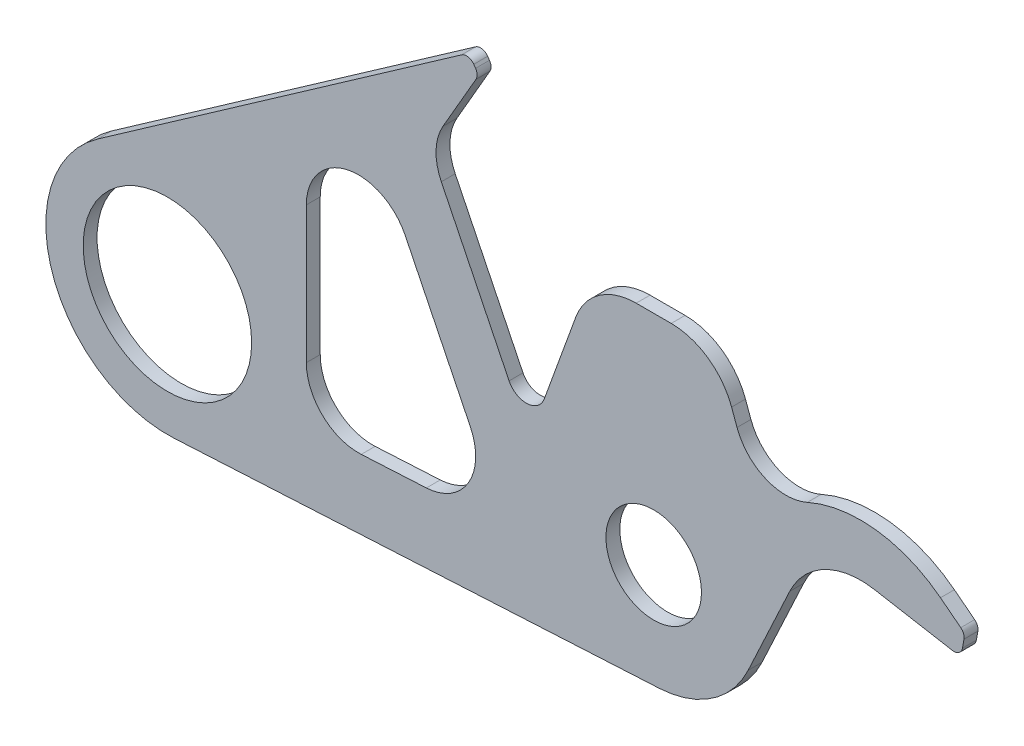
ISO-10303-21;
HEADER;
FILE_DESCRIPTION(('STEP AP214'),'2;1');
FILE_NAME('part.step','',(''),(''),'','','');
FILE_SCHEMA(('AUTOMOTIVE_DESIGN { 1 0 10303 214 1 1 1 1 }'));
ENDSEC;
DATA;
#1=APPLICATION_CONTEXT('core data for automotive mechanical design processes');
#2=APPLICATION_PROTOCOL_DEFINITION('international standard','automotive_design',2000,#1);
#3=PRODUCT_CONTEXT('',#1,'mechanical');
#4=PRODUCT('Part','Part','',(#3));
#5=PRODUCT_RELATED_PRODUCT_CATEGORY('part','',(#4));
#6=PRODUCT_DEFINITION_FORMATION('','',#4);
#7=PRODUCT_DEFINITION_CONTEXT('part definition',#1,'design');
#8=PRODUCT_DEFINITION('design','',#6,#7);
#9=PRODUCT_DEFINITION_SHAPE('','',#8);
#10=(LENGTH_UNIT() NAMED_UNIT(*) SI_UNIT(.MILLI.,.METRE.));
#11=(NAMED_UNIT(*) PLANE_ANGLE_UNIT() SI_UNIT($,.RADIAN.));
#12=(NAMED_UNIT(*) SI_UNIT($,.STERADIAN.) SOLID_ANGLE_UNIT());
#13=UNCERTAINTY_MEASURE_WITH_UNIT(LENGTH_MEASURE(1.E-05),#10,'distance_accuracy_value','');
#14=(GEOMETRIC_REPRESENTATION_CONTEXT(3) GLOBAL_UNCERTAINTY_ASSIGNED_CONTEXT((#13)) GLOBAL_UNIT_ASSIGNED_CONTEXT((#10,
#11,#12)) REPRESENTATION_CONTEXT('',''));
#15=CARTESIAN_POINT('',(0.,0.,0.));
#16=DIRECTION('',(0.,0.,1.));
#17=DIRECTION('',(1.,0.,0.));
#18=AXIS2_PLACEMENT_3D('',#15,#16,#17);
#19=CARTESIAN_POINT('',(172.305559633051,200.,8.));
#20=DIRECTION('',(0.,0.,1.));
#21=DIRECTION('',(1.,0.,0.));
#22=AXIS2_PLACEMENT_3D('',#19,#20,#21);
#23=PLANE('',#22);
#24=CARTESIAN_POINT('',(280.,5.,8.));
#25=DIRECTION('',(0.,0.,1.));
#26=DIRECTION('',(1.,0.,0.));
#27=AXIS2_PLACEMENT_3D('',#24,#25,#26);
#28=CIRCLE('',#27,27.5);
#29=CARTESIAN_POINT('',(307.5,5.,8.));
#30=VERTEX_POINT('',#29);
#31=EDGE_CURVE('E293',#30,#30,#28,.T.);
#32=ORIENTED_EDGE('',*,*,#31,.F.);
#33=EDGE_LOOP('',(#32));
#34=FACE_BOUND('',#33,.T.);
#35=CARTESIAN_POINT('',(172.305559633051,200.,8.));
#36=DIRECTION('',(0.,0.,1.));
#37=DIRECTION('',(1.,0.,0.));
#38=AXIS2_PLACEMENT_3D('',#35,#36,#37);
#39=CIRCLE('',#38,4.99999999999994);
#40=CARTESIAN_POINT('',(176.401319854495,202.867882181755,8.));
#41=VERTEX_POINT('',#40);
#42=CARTESIAN_POINT('',(169.437677451295,204.095760221445,8.));
#43=VERTEX_POINT('',#42);
#44=EDGE_CURVE('E305',#41,#43,#39,.T.);
#45=ORIENTED_EDGE('',*,*,#44,.T.);
#46=DIRECTION('',(-0.819152044288991,-0.573576436351048,0.));
#47=VECTOR('',#46,1.);
#48=CARTESIAN_POINT('',(-40.1503505445734,57.3406431002294,8.));
#49=LINE('',#48,#47);
#50=CARTESIAN_POINT('',(-40.1503505445734,57.3406431002293,8.));
#51=VERTEX_POINT('',#50);
#52=EDGE_CURVE('E308',#43,#51,#49,.T.);
#53=ORIENTED_EDGE('',*,*,#52,.T.);
#54=CARTESIAN_POINT('',(0.,0.,8.));
#55=DIRECTION('',(0.,0.,1.));
#56=DIRECTION('',(1.,0.,0.));
#57=AXIS2_PLACEMENT_3D('',#54,#55,#56);
#58=CIRCLE('',#57,70.);
#59=CARTESIAN_POINT('',(3.74820674254505,-69.8995775825229,8.));
#60=VERTEX_POINT('',#59);
#61=EDGE_CURVE('E311',#51,#60,#58,.T.);
#62=ORIENTED_EDGE('',*,*,#61,.T.);
#63=DIRECTION('',(0.998565394036042,0.0535458106077864,0.));
#64=VECTOR('',#63,1.);
#65=CARTESIAN_POINT('',(283.212748636467,-54.9139236421625,8.));
#66=LINE('',#65,#64);
#67=CARTESIAN_POINT('',(283.212748636467,-54.9139236421625,8.));
#68=VERTEX_POINT('',#67);
#69=EDGE_CURVE('E313',#60,#68,#66,.T.);
#70=ORIENTED_EDGE('',*,*,#69,.T.);
#71=CARTESIAN_POINT('',(280.,5.,8.));
#72=DIRECTION('',(0.,0.,1.));
#73=DIRECTION('',(1.,0.,0.));
#74=AXIS2_PLACEMENT_3D('',#71,#72,#73);
#75=CIRCLE('',#74,60.);
#76=CARTESIAN_POINT('',(334.378467222199,-20.3570957044423,8.));
#77=VERTEX_POINT('',#76);
#78=EDGE_CURVE('E315',#68,#77,#75,.T.);
#79=ORIENTED_EDGE('',*,*,#78,.T.);
#80=DIRECTION('',(0.422618261740704,0.906307787036648,0.));
#81=VECTOR('',#80,1.);
#82=CARTESIAN_POINT('',(358.334984681498,31.0178217783317,8.));
#83=LINE('',#82,#81);
#84=CARTESIAN_POINT('',(358.334984681498,31.0178217783317,8.));
#85=VERTEX_POINT('',#84);
#86=EDGE_CURVE('E317',#77,#85,#83,.T.);
#87=ORIENTED_EDGE('',*,*,#86,.T.);
#88=CARTESIAN_POINT('',(399.118835098147,12.,8.));
#89=DIRECTION('',(0.,0.,-1.));
#90=DIRECTION('',(1.,0.,0.));
#91=AXIS2_PLACEMENT_3D('',#88,#89,#90);
#92=CIRCLE('',#91,45.);
#93=CARTESIAN_POINT('',(406.933003093159,56.3163488855495,8.));
#94=VERTEX_POINT('',#93);
#95=EDGE_CURVE('E319',#85,#94,#92,.T.);
#96=ORIENTED_EDGE('',*,*,#95,.T.);
#97=DIRECTION('',(0.984807753012209,-0.173648177666923,0.));
#98=VECTOR('',#97,1.);
#99=CARTESIAN_POINT('',(452.008963478123,48.3682408883346,8.));
#100=LINE('',#99,#98);
#101=CARTESIAN_POINT('',(452.008963478123,48.3682408883347,8.));
#102=VERTEX_POINT('',#101);
#103=EDGE_CURVE('E321',#94,#102,#100,.T.);
#104=ORIENTED_EDGE('',*,*,#103,.T.);
#105=CARTESIAN_POINT('',(452.877204366458,53.2922796533956,8.));
#106=DIRECTION('',(0.,0.,1.));
#107=DIRECTION('',(1.,0.,0.));
#108=AXIS2_PLACEMENT_3D('',#105,#106,#107);
#109=CIRCLE('',#108,4.99999999999992);
#110=CARTESIAN_POINT('',(457.801243131519,52.424038765061,8.));
#111=VERTEX_POINT('',#110);
#112=EDGE_CURVE('E323',#102,#111,#109,.T.);
#113=ORIENTED_EDGE('',*,*,#112,.T.);
#114=DIRECTION('',(0.173648177666926,0.984807753012209,0.));
#115=VECTOR('',#114,1.);
#116=CARTESIAN_POINT('',(457.801243131519,52.424038765061,8.));
#117=LINE('',#116,#115);
#118=CARTESIAN_POINT('',(458.667177937596,57.3349990877386,8.));
#119=VERTEX_POINT('',#118);
#120=EDGE_CURVE('E325',#111,#119,#117,.T.);
#121=ORIENTED_EDGE('',*,*,#120,.T.);
#122=CARTESIAN_POINT('',(453.743139172535,58.2032399760731,8.));
#123=DIRECTION('',(0.,0.,1.));
#124=DIRECTION('',(1.,0.,0.));
#125=AXIS2_PLACEMENT_3D('',#122,#123,#124);
#126=CIRCLE('',#125,4.99999999999984);
#127=CARTESIAN_POINT('',(456.811048982435,62.1513951653122,8.));
#128=VERTEX_POINT('',#127);
#129=EDGE_CURVE('E327',#119,#128,#126,.T.);
#130=ORIENTED_EDGE('',*,*,#129,.T.);
#131=DIRECTION('',(-0.789631037847821,0.613581961980119,0.));
#132=VECTOR('',#131,1.);
#133=CARTESIAN_POINT('',(456.811048982435,62.1513951653122,8.));
#134=LINE('',#133,#132);
#135=CARTESIAN_POINT('',(445.137482246656,71.2223278385866,8.));
#136=VERTEX_POINT('',#135);
#137=EDGE_CURVE('E329',#128,#136,#134,.T.);
#138=ORIENTED_EDGE('',*,*,#137,.T.);
#139=CARTESIAN_POINT('',(399.118835098147,12.,8.));
#140=DIRECTION('',(0.,0.,1.));
#141=DIRECTION('',(1.,0.,0.));
#142=AXIS2_PLACEMENT_3D('',#139,#140,#141);
#143=CIRCLE('',#142,75.);
#144=CARTESIAN_POINT('',(368.448599855271,80.4422140944217,8.));
#145=VERTEX_POINT('',#144);
#146=EDGE_CURVE('E331',#136,#145,#143,.T.);
#147=ORIENTED_EDGE('',*,*,#146,.T.);
#148=CARTESIAN_POINT('',(356.180505758121,107.81909973219,8.));
#149=DIRECTION('',(0.,0.,-1.));
#150=DIRECTION('',(1.,0.,0.));
#151=AXIS2_PLACEMENT_3D('',#148,#149,#150);
#152=CIRCLE('',#151,30.);
#153=CARTESIAN_POINT('',(327.989727134544,97.5584954324194,8.));
#154=VERTEX_POINT('',#153);
#155=EDGE_CURVE('E333',#145,#154,#152,.T.);
#156=ORIENTED_EDGE('',*,*,#155,.T.);
#157=DIRECTION('',(-0.342020143325695,0.939692620785899,0.));
#158=VECTOR('',#157,1.);
#159=CARTESIAN_POINT('',(324.860948055319,106.154745303051,8.));
#160=LINE('',#159,#158);
#161=CARTESIAN_POINT('',(324.860948055319,106.154745303051,8.));
#162=VERTEX_POINT('',#161);
#163=EDGE_CURVE('E335',#154,#162,#160,.T.);
#164=ORIENTED_EDGE('',*,*,#163,.T.);
#165=CARTESIAN_POINT('',(290.092321086241,93.5,8.));
#166=DIRECTION('',(0.,0.,1.));
#167=DIRECTION('',(1.,0.,0.));
#168=AXIS2_PLACEMENT_3D('',#165,#166,#167);
#169=CIRCLE('',#168,37.);
#170=CARTESIAN_POINT('',(290.092321086241,130.5,8.));
#171=VERTEX_POINT('',#170);
#172=EDGE_CURVE('E337',#162,#171,#169,.T.);
#173=ORIENTED_EDGE('',*,*,#172,.T.);
#174=DIRECTION('',(-1.,0.,0.));
#175=VECTOR('',#174,1.);
#176=CARTESIAN_POINT('',(269.907678913759,130.5,8.));
#177=LINE('',#176,#175);
#178=CARTESIAN_POINT('',(269.907678913759,130.5,8.));
#179=VERTEX_POINT('',#178);
#180=EDGE_CURVE('E339',#171,#179,#177,.T.);
#181=ORIENTED_EDGE('',*,*,#180,.T.);
#182=CARTESIAN_POINT('',(269.907678913759,93.5,8.));
#183=DIRECTION('',(0.,0.,1.));
#184=DIRECTION('',(1.,0.,0.));
#185=AXIS2_PLACEMENT_3D('',#182,#183,#184);
#186=CIRCLE('',#185,37.);
#187=CARTESIAN_POINT('',(235.13905194468,106.154745303049,8.));
#188=VERTEX_POINT('',#187);
#189=EDGE_CURVE('E341',#179,#188,#186,.T.);
#190=ORIENTED_EDGE('',*,*,#189,.T.);
#191=DIRECTION('',(-0.342020143325649,-0.939692620785916,0.));
#192=VECTOR('',#191,1.);
#193=CARTESIAN_POINT('',(216.970143635203,56.2360799866146,8.));
#194=LINE('',#193,#192);
#195=CARTESIAN_POINT('',(216.970143635203,56.2360799866146,8.));
#196=VERTEX_POINT('',#195);
#197=EDGE_CURVE('E343',#188,#196,#194,.T.);
#198=ORIENTED_EDGE('',*,*,#197,.T.);
#199=CARTESIAN_POINT('',(206.628858389792,60.,8.));
#200=DIRECTION('',(0.,0.,-1.));
#201=DIRECTION('',(1.,0.,0.));
#202=AXIS2_PLACEMENT_3D('',#199,#200,#201);
#203=CIRCLE('',#202,11.0049658969986);
#204=CARTESIAN_POINT('',(196.743512668202,55.1637603079736,8.));
#205=VERTEX_POINT('',#204);
#206=EDGE_CURVE('E345',#196,#205,#203,.T.);
#207=ORIENTED_EDGE('',*,*,#206,.T.);
#208=DIRECTION('',(-0.439459761828555,0.898262276695169,0.));
#209=VECTOR('',#208,1.);
#210=CARTESIAN_POINT('',(157.71716798188,134.934188169585,8.));
#211=LINE('',#210,#209);
#212=CARTESIAN_POINT('',(157.71716798188,134.934188169585,8.));
#213=VERTEX_POINT('',#212);
#214=EDGE_CURVE('E347',#205,#213,#211,.T.);
#215=ORIENTED_EDGE('',*,*,#214,.T.);
#216=CARTESIAN_POINT('',(184.665036282735,148.117981024441,8.));
#217=DIRECTION('',(0.,0.,-1.));
#218=DIRECTION('',(1.,0.,0.));
#219=AXIS2_PLACEMENT_3D('',#216,#217,#218);
#220=CIRCLE('',#219,29.9999999999998);
#221=CARTESIAN_POINT('',(158.684274169202,163.117981024441,8.));
#222=VERTEX_POINT('',#221);
#223=EDGE_CURVE('E349',#213,#222,#220,.T.);
#224=ORIENTED_EDGE('',*,*,#223,.T.);
#225=DIRECTION('',(0.499999999999997,0.86602540378444,0.));
#226=VECTOR('',#225,1.);
#227=CARTESIAN_POINT('',(177.676526384232,196.013526811036,8.));
#228=LINE('',#227,#226);
#229=CARTESIAN_POINT('',(177.676526384232,196.013526811036,8.));
#230=VERTEX_POINT('',#229);
#231=EDGE_CURVE('E351',#222,#230,#228,.T.);
#232=ORIENTED_EDGE('',*,*,#231,.T.);
#233=CARTESIAN_POINT('',(173.34639936531,198.513526811036,8.));
#234=DIRECTION('',(0.,0.,1.));
#235=DIRECTION('',(1.,0.,0.));
#236=AXIS2_PLACEMENT_3D('',#233,#234,#235);
#237=CIRCLE('',#236,4.99999999999969);
#238=CARTESIAN_POINT('',(177.442159586755,201.381408992791,8.));
#239=VERTEX_POINT('',#238);
#240=EDGE_CURVE('E353',#230,#239,#237,.T.);
#241=ORIENTED_EDGE('',*,*,#240,.T.);
#242=DIRECTION('',(-0.573576436351047,0.819152044288991,0.));
#243=VECTOR('',#242,1.);
#244=CARTESIAN_POINT('',(176.401319854495,202.867882181755,8.));
#245=LINE('',#244,#243);
#246=EDGE_CURVE('E355',#239,#41,#245,.T.);
#247=ORIENTED_EDGE('',*,*,#246,.T.);
#248=EDGE_LOOP('',(#45,#53,#62,#70,#79,#87,#96,#104,#113,#121,#130,#138,#147,#156,#164,#173,
#181,#190,#198,#207,#215,#224,#232,#241,#247));
#249=FACE_BOUND('',#248,.T.);
#250=CARTESIAN_POINT('',(0.,0.,8.));
#251=DIRECTION('',(0.,0.,1.));
#252=DIRECTION('',(1.,0.,0.));
#253=AXIS2_PLACEMENT_3D('',#250,#251,#252);
#254=CIRCLE('',#253,48.5);
#255=CARTESIAN_POINT('',(48.5,0.,8.));
#256=VERTEX_POINT('',#255);
#257=EDGE_CURVE('E299',#256,#256,#254,.T.);
#258=ORIENTED_EDGE('',*,*,#257,.F.);
#259=EDGE_LOOP('',(#258));
#260=FACE_BOUND('',#259,.T.);
#261=DIRECTION('',(0.998565394036041,0.0535458106077866,0.));
#262=VECTOR('',#261,1.);
#263=CARTESIAN_POINT('',(111.606374318234,-24.0584606292365,8.));
#264=LINE('',#263,#262);
#265=CARTESIAN_POINT('',(111.606374318234,-24.0584606292365,8.));
#266=VERTEX_POINT('',#265);
#267=CARTESIAN_POINT('',(149.106374318234,-22.0476079501985,8.));
#268=VERTEX_POINT('',#267);
#269=EDGE_CURVE('E250',#266,#268,#264,.T.);
#270=ORIENTED_EDGE('',*,*,#269,.F.);
#271=CARTESIAN_POINT('',(110.,5.89850119184475,8.));
#272=DIRECTION('',(0.,0.,1.));
#273=DIRECTION('',(1.,0.,0.));
#274=AXIS2_PLACEMENT_3D('',#271,#272,#273);
#275=CIRCLE('',#274,30.);
#276=CARTESIAN_POINT('',(80.,5.89850119184475,8.));
#277=VERTEX_POINT('',#276);
#278=EDGE_CURVE('E242',#277,#266,#275,.T.);
#279=ORIENTED_EDGE('',*,*,#278,.F.);
#280=DIRECTION('',(0.,-1.,0.));
#281=VECTOR('',#280,1.);
#282=CARTESIAN_POINT('',(80.,84.5599105359778,8.));
#283=LINE('',#282,#281);
#284=CARTESIAN_POINT('',(80.,84.5599105359778,8.));
#285=VERTEX_POINT('',#284);
#286=EDGE_CURVE('E271',#285,#277,#283,.T.);
#287=ORIENTED_EDGE('',*,*,#286,.F.);
#288=CARTESIAN_POINT('',(110.,84.5599105359778,8.));
#289=DIRECTION('',(0.,0.,1.));
#290=DIRECTION('',(1.,0.,0.));
#291=AXIS2_PLACEMENT_3D('',#288,#289,#290);
#292=CIRCLE('',#291,30.);
#293=CARTESIAN_POINT('',(136.947868300855,97.7437033908344,8.));
#294=VERTEX_POINT('',#293);
#295=EDGE_CURVE('E269',#294,#285,#292,.T.);
#296=ORIENTED_EDGE('',*,*,#295,.F.);
#297=DIRECTION('',(-0.439459761828556,0.898262276695169,0.));
#298=VECTOR('',#297,1.);
#299=CARTESIAN_POINT('',(174.447868300855,21.0931467257394,8.));
#300=LINE('',#299,#298);
#301=CARTESIAN_POINT('',(174.447868300855,21.0931467257394,8.));
#302=VERTEX_POINT('',#301);
#303=EDGE_CURVE('E265',#302,#294,#300,.T.);
#304=ORIENTED_EDGE('',*,*,#303,.F.);
#305=CARTESIAN_POINT('',(147.5,7.90935387088276,8.));
#306=DIRECTION('',(0.,0.,1.));
#307=DIRECTION('',(1.,0.,0.));
#308=AXIS2_PLACEMENT_3D('',#305,#306,#307);
#309=CIRCLE('',#308,30.);
#310=EDGE_CURVE('E263',#268,#302,#309,.T.);
#311=ORIENTED_EDGE('',*,*,#310,.F.);
#312=EDGE_LOOP('',(#270,#279,#287,#296,#304,#311));
#313=FACE_BOUND('',#312,.T.);
#314=ADVANCED_FACE('F39',(#34,#249,#260,#313),#23,.T.);
#315=CARTESIAN_POINT('',(172.305559633051,200.,0.));
#316=DIRECTION('',(0.,0.,1.));
#317=DIRECTION('',(1.,0.,0.));
#318=AXIS2_PLACEMENT_3D('',#315,#316,#317);
#319=PLANE('',#318);
#320=CARTESIAN_POINT('',(280.,5.,0.));
#321=DIRECTION('',(0.,0.,1.));
#322=DIRECTION('',(1.,0.,0.));
#323=AXIS2_PLACEMENT_3D('',#320,#321,#322);
#324=CIRCLE('',#323,27.5);
#325=CARTESIAN_POINT('',(307.5,5.,0.));
#326=VERTEX_POINT('',#325);
#327=EDGE_CURVE('E258',#326,#326,#324,.T.);
#328=ORIENTED_EDGE('',*,*,#327,.T.);
#329=EDGE_LOOP('',(#328));
#330=FACE_BOUND('',#329,.T.);
#331=CARTESIAN_POINT('',(172.305559633051,200.,0.));
#332=DIRECTION('',(0.,0.,1.));
#333=DIRECTION('',(1.,0.,0.));
#334=AXIS2_PLACEMENT_3D('',#331,#332,#333);
#335=CIRCLE('',#334,4.99999999999994);
#336=CARTESIAN_POINT('',(176.401319854495,202.867882181755,0.));
#337=VERTEX_POINT('',#336);
#338=CARTESIAN_POINT('',(169.437677451295,204.095760221445,0.));
#339=VERTEX_POINT('',#338);
#340=EDGE_CURVE('E302',#337,#339,#335,.T.);
#341=ORIENTED_EDGE('',*,*,#340,.F.);
#342=DIRECTION('',(-0.573576436351047,0.819152044288991,0.));
#343=VECTOR('',#342,1.);
#344=CARTESIAN_POINT('',(176.401319854495,202.867882181755,0.));
#345=LINE('',#344,#343);
#346=CARTESIAN_POINT('',(177.442159586755,201.381408992791,0.));
#347=VERTEX_POINT('',#346);
#348=EDGE_CURVE('E309',#347,#337,#345,.T.);
#349=ORIENTED_EDGE('',*,*,#348,.F.);
#350=CARTESIAN_POINT('',(173.34639936531,198.513526811036,0.));
#351=DIRECTION('',(0.,0.,1.));
#352=DIRECTION('',(1.,0.,0.));
#353=AXIS2_PLACEMENT_3D('',#350,#351,#352);
#354=CIRCLE('',#353,4.99999999999969);
#355=CARTESIAN_POINT('',(177.676526384232,196.013526811036,0.));
#356=VERTEX_POINT('',#355);
#357=EDGE_CURVE('E404',#356,#347,#354,.T.);
#358=ORIENTED_EDGE('',*,*,#357,.F.);
#359=DIRECTION('',(0.499999999999997,0.86602540378444,0.));
#360=VECTOR('',#359,1.);
#361=CARTESIAN_POINT('',(177.676526384232,196.013526811036,0.));
#362=LINE('',#361,#360);
#363=CARTESIAN_POINT('',(158.684274169202,163.117981024441,0.));
#364=VERTEX_POINT('',#363);
#365=EDGE_CURVE('E402',#364,#356,#362,.T.);
#366=ORIENTED_EDGE('',*,*,#365,.F.);
#367=CARTESIAN_POINT('',(184.665036282735,148.117981024441,0.));
#368=DIRECTION('',(0.,0.,-1.));
#369=DIRECTION('',(1.,0.,0.));
#370=AXIS2_PLACEMENT_3D('',#367,#368,#369);
#371=CIRCLE('',#370,29.9999999999998);
#372=CARTESIAN_POINT('',(157.71716798188,134.934188169585,0.));
#373=VERTEX_POINT('',#372);
#374=EDGE_CURVE('E400',#373,#364,#371,.T.);
#375=ORIENTED_EDGE('',*,*,#374,.F.);
#376=DIRECTION('',(-0.439459761828555,0.898262276695169,0.));
#377=VECTOR('',#376,1.);
#378=CARTESIAN_POINT('',(157.71716798188,134.934188169585,0.));
#379=LINE('',#378,#377);
#380=CARTESIAN_POINT('',(196.743512668202,55.1637603079736,0.));
#381=VERTEX_POINT('',#380);
#382=EDGE_CURVE('E398',#381,#373,#379,.T.);
#383=ORIENTED_EDGE('',*,*,#382,.F.);
#384=CARTESIAN_POINT('',(206.628858389792,60.,0.));
#385=DIRECTION('',(0.,0.,-1.));
#386=DIRECTION('',(1.,0.,0.));
#387=AXIS2_PLACEMENT_3D('',#384,#385,#386);
#388=CIRCLE('',#387,11.0049658969986);
#389=CARTESIAN_POINT('',(216.970143635203,56.2360799866146,0.));
#390=VERTEX_POINT('',#389);
#391=EDGE_CURVE('E396',#390,#381,#388,.T.);
#392=ORIENTED_EDGE('',*,*,#391,.F.);
#393=DIRECTION('',(-0.342020143325649,-0.939692620785916,0.));
#394=VECTOR('',#393,1.);
#395=CARTESIAN_POINT('',(216.970143635203,56.2360799866146,0.));
#396=LINE('',#395,#394);
#397=CARTESIAN_POINT('',(235.13905194468,106.154745303049,0.));
#398=VERTEX_POINT('',#397);
#399=EDGE_CURVE('E394',#398,#390,#396,.T.);
#400=ORIENTED_EDGE('',*,*,#399,.F.);
#401=CARTESIAN_POINT('',(269.907678913759,93.5,0.));
#402=DIRECTION('',(0.,0.,1.));
#403=DIRECTION('',(1.,0.,0.));
#404=AXIS2_PLACEMENT_3D('',#401,#402,#403);
#405=CIRCLE('',#404,37.);
#406=CARTESIAN_POINT('',(269.907678913759,130.5,0.));
#407=VERTEX_POINT('',#406);
#408=EDGE_CURVE('E392',#407,#398,#405,.T.);
#409=ORIENTED_EDGE('',*,*,#408,.F.);
#410=DIRECTION('',(-1.,0.,0.));
#411=VECTOR('',#410,1.);
#412=CARTESIAN_POINT('',(269.907678913759,130.5,0.));
#413=LINE('',#412,#411);
#414=CARTESIAN_POINT('',(290.092321086241,130.5,0.));
#415=VERTEX_POINT('',#414);
#416=EDGE_CURVE('E390',#415,#407,#413,.T.);
#417=ORIENTED_EDGE('',*,*,#416,.F.);
#418=CARTESIAN_POINT('',(290.092321086241,93.5,0.));
#419=DIRECTION('',(0.,0.,1.));
#420=DIRECTION('',(1.,0.,0.));
#421=AXIS2_PLACEMENT_3D('',#418,#419,#420);
#422=CIRCLE('',#421,37.);
#423=CARTESIAN_POINT('',(324.860948055319,106.154745303051,0.));
#424=VERTEX_POINT('',#423);
#425=EDGE_CURVE('E388',#424,#415,#422,.T.);
#426=ORIENTED_EDGE('',*,*,#425,.F.);
#427=DIRECTION('',(-0.342020143325695,0.939692620785899,0.));
#428=VECTOR('',#427,1.);
#429=CARTESIAN_POINT('',(324.860948055319,106.154745303051,0.));
#430=LINE('',#429,#428);
#431=CARTESIAN_POINT('',(327.989727134544,97.5584954324194,0.));
#432=VERTEX_POINT('',#431);
#433=EDGE_CURVE('E386',#432,#424,#430,.T.);
#434=ORIENTED_EDGE('',*,*,#433,.F.);
#435=CARTESIAN_POINT('',(356.180505758121,107.81909973219,0.));
#436=DIRECTION('',(0.,0.,-1.));
#437=DIRECTION('',(1.,0.,0.));
#438=AXIS2_PLACEMENT_3D('',#435,#436,#437);
#439=CIRCLE('',#438,30.);
#440=CARTESIAN_POINT('',(368.448599855271,80.4422140944217,0.));
#441=VERTEX_POINT('',#440);
#442=EDGE_CURVE('E384',#441,#432,#439,.T.);
#443=ORIENTED_EDGE('',*,*,#442,.F.);
#444=CARTESIAN_POINT('',(399.118835098147,12.,0.));
#445=DIRECTION('',(0.,0.,1.));
#446=DIRECTION('',(1.,0.,0.));
#447=AXIS2_PLACEMENT_3D('',#444,#445,#446);
#448=CIRCLE('',#447,75.);
#449=CARTESIAN_POINT('',(445.137482246656,71.2223278385866,0.));
#450=VERTEX_POINT('',#449);
#451=EDGE_CURVE('E382',#450,#441,#448,.T.);
#452=ORIENTED_EDGE('',*,*,#451,.F.);
#453=DIRECTION('',(-0.789631037847821,0.613581961980119,0.));
#454=VECTOR('',#453,1.);
#455=CARTESIAN_POINT('',(456.811048982435,62.1513951653122,0.));
#456=LINE('',#455,#454);
#457=CARTESIAN_POINT('',(456.811048982435,62.1513951653122,0.));
#458=VERTEX_POINT('',#457);
#459=EDGE_CURVE('E380',#458,#450,#456,.T.);
#460=ORIENTED_EDGE('',*,*,#459,.F.);
#461=CARTESIAN_POINT('',(453.743139172535,58.2032399760731,0.));
#462=DIRECTION('',(0.,0.,1.));
#463=DIRECTION('',(1.,0.,0.));
#464=AXIS2_PLACEMENT_3D('',#461,#462,#463);
#465=CIRCLE('',#464,4.99999999999984);
#466=CARTESIAN_POINT('',(458.667177937596,57.3349990877386,0.));
#467=VERTEX_POINT('',#466);
#468=EDGE_CURVE('E378',#467,#458,#465,.T.);
#469=ORIENTED_EDGE('',*,*,#468,.F.);
#470=DIRECTION('',(0.173648177666926,0.984807753012209,0.));
#471=VECTOR('',#470,1.);
#472=CARTESIAN_POINT('',(457.801243131519,52.424038765061,0.));
#473=LINE('',#472,#471);
#474=CARTESIAN_POINT('',(457.801243131519,52.424038765061,0.));
#475=VERTEX_POINT('',#474);
#476=EDGE_CURVE('E376',#475,#467,#473,.T.);
#477=ORIENTED_EDGE('',*,*,#476,.F.);
#478=CARTESIAN_POINT('',(452.877204366458,53.2922796533956,0.));
#479=DIRECTION('',(0.,0.,1.));
#480=DIRECTION('',(1.,0.,0.));
#481=AXIS2_PLACEMENT_3D('',#478,#479,#480);
#482=CIRCLE('',#481,4.99999999999992);
#483=CARTESIAN_POINT('',(452.008963478123,48.3682408883347,0.));
#484=VERTEX_POINT('',#483);
#485=EDGE_CURVE('E374',#484,#475,#482,.T.);
#486=ORIENTED_EDGE('',*,*,#485,.F.);
#487=DIRECTION('',(0.984807753012209,-0.173648177666923,0.));
#488=VECTOR('',#487,1.);
#489=CARTESIAN_POINT('',(452.008963478123,48.3682408883346,0.));
#490=LINE('',#489,#488);
#491=CARTESIAN_POINT('',(406.933003093159,56.3163488855495,0.));
#492=VERTEX_POINT('',#491);
#493=EDGE_CURVE('E372',#492,#484,#490,.T.);
#494=ORIENTED_EDGE('',*,*,#493,.F.);
#495=CARTESIAN_POINT('',(399.118835098147,12.,0.));
#496=DIRECTION('',(0.,0.,-1.));
#497=DIRECTION('',(1.,0.,0.));
#498=AXIS2_PLACEMENT_3D('',#495,#496,#497);
#499=CIRCLE('',#498,45.);
#500=CARTESIAN_POINT('',(358.334984681498,31.0178217783317,0.));
#501=VERTEX_POINT('',#500);
#502=EDGE_CURVE('E370',#501,#492,#499,.T.);
#503=ORIENTED_EDGE('',*,*,#502,.F.);
#504=DIRECTION('',(0.422618261740704,0.906307787036648,0.));
#505=VECTOR('',#504,1.);
#506=CARTESIAN_POINT('',(358.334984681498,31.0178217783317,0.));
#507=LINE('',#506,#505);
#508=CARTESIAN_POINT('',(334.378467222199,-20.3570957044423,0.));
#509=VERTEX_POINT('',#508);
#510=EDGE_CURVE('E368',#509,#501,#507,.T.);
#511=ORIENTED_EDGE('',*,*,#510,.F.);
#512=CARTESIAN_POINT('',(280.,5.,0.));
#513=DIRECTION('',(0.,0.,1.));
#514=DIRECTION('',(1.,0.,0.));
#515=AXIS2_PLACEMENT_3D('',#512,#513,#514);
#516=CIRCLE('',#515,60.);
#517=CARTESIAN_POINT('',(283.212748636467,-54.9139236421625,0.));
#518=VERTEX_POINT('',#517);
#519=EDGE_CURVE('E366',#518,#509,#516,.T.);
#520=ORIENTED_EDGE('',*,*,#519,.F.);
#521=DIRECTION('',(0.998565394036042,0.0535458106077864,0.));
#522=VECTOR('',#521,1.);
#523=CARTESIAN_POINT('',(283.212748636467,-54.9139236421625,0.));
#524=LINE('',#523,#522);
#525=CARTESIAN_POINT('',(3.74820674254505,-69.8995775825229,0.));
#526=VERTEX_POINT('',#525);
#527=EDGE_CURVE('E364',#526,#518,#524,.T.);
#528=ORIENTED_EDGE('',*,*,#527,.F.);
#529=CARTESIAN_POINT('',(0.,0.,0.));
#530=DIRECTION('',(0.,0.,1.));
#531=DIRECTION('',(1.,0.,0.));
#532=AXIS2_PLACEMENT_3D('',#529,#530,#531);
#533=CIRCLE('',#532,70.);
#534=CARTESIAN_POINT('',(-40.1503505445734,57.3406431002293,0.));
#535=VERTEX_POINT('',#534);
#536=EDGE_CURVE('E362',#535,#526,#533,.T.);
#537=ORIENTED_EDGE('',*,*,#536,.F.);
#538=DIRECTION('',(-0.819152044288991,-0.573576436351048,0.));
#539=VECTOR('',#538,1.);
#540=CARTESIAN_POINT('',(-40.1503505445734,57.3406431002294,0.));
#541=LINE('',#540,#539);
#542=EDGE_CURVE('E360',#339,#535,#541,.T.);
#543=ORIENTED_EDGE('',*,*,#542,.F.);
#544=EDGE_LOOP('',(#341,#349,#358,#366,#375,#383,#392,#400,#409,#417,#426,#434,#443,#452,#460,
#469,#477,#486,#494,#503,#511,#520,#528,#537,#543));
#545=FACE_BOUND('',#544,.T.);
#546=CARTESIAN_POINT('',(0.,0.,0.));
#547=DIRECTION('',(0.,0.,1.));
#548=DIRECTION('',(1.,0.,0.));
#549=AXIS2_PLACEMENT_3D('',#546,#547,#548);
#550=CIRCLE('',#549,48.5);
#551=CARTESIAN_POINT('',(48.5,0.,0.));
#552=VERTEX_POINT('',#551);
#553=EDGE_CURVE('E296',#552,#552,#550,.T.);
#554=ORIENTED_EDGE('',*,*,#553,.T.);
#555=EDGE_LOOP('',(#554));
#556=FACE_BOUND('',#555,.T.);
#557=CARTESIAN_POINT('',(110.,5.89850119184475,0.));
#558=DIRECTION('',(0.,0.,1.));
#559=DIRECTION('',(1.,0.,0.));
#560=AXIS2_PLACEMENT_3D('',#557,#558,#559);
#561=CIRCLE('',#560,30.);
#562=CARTESIAN_POINT('',(80.,5.89850119184476,0.));
#563=VERTEX_POINT('',#562);
#564=CARTESIAN_POINT('',(111.606374318234,-24.0584606292365,0.));
#565=VERTEX_POINT('',#564);
#566=EDGE_CURVE('E62',#563,#565,#561,.T.);
#567=ORIENTED_EDGE('',*,*,#566,.T.);
#568=DIRECTION('',(0.998565394036041,0.0535458106077866,0.));
#569=VECTOR('',#568,1.);
#570=CARTESIAN_POINT('',(111.606374318234,-24.0584606292365,0.));
#571=LINE('',#570,#569);
#572=CARTESIAN_POINT('',(149.106374318234,-22.0476079501985,0.));
#573=VERTEX_POINT('',#572);
#574=EDGE_CURVE('E257',#565,#573,#571,.T.);
#575=ORIENTED_EDGE('',*,*,#574,.T.);
#576=CARTESIAN_POINT('',(147.5,7.90935387088276,0.));
#577=DIRECTION('',(0.,0.,1.));
#578=DIRECTION('',(1.,0.,0.));
#579=AXIS2_PLACEMENT_3D('',#576,#577,#578);
#580=CIRCLE('',#579,30.);
#581=CARTESIAN_POINT('',(174.447868300855,21.0931467257394,0.));
#582=VERTEX_POINT('',#581);
#583=EDGE_CURVE('E275',#573,#582,#580,.T.);
#584=ORIENTED_EDGE('',*,*,#583,.T.);
#585=DIRECTION('',(-0.439459761828556,0.898262276695169,0.));
#586=VECTOR('',#585,1.);
#587=CARTESIAN_POINT('',(174.447868300855,21.0931467257394,0.));
#588=LINE('',#587,#586);
#589=CARTESIAN_POINT('',(136.947868300855,97.7437033908344,0.));
#590=VERTEX_POINT('',#589);
#591=EDGE_CURVE('E278',#582,#590,#588,.T.);
#592=ORIENTED_EDGE('',*,*,#591,.T.);
#593=CARTESIAN_POINT('',(110.,84.5599105359778,0.));
#594=DIRECTION('',(0.,0.,1.));
#595=DIRECTION('',(1.,0.,0.));
#596=AXIS2_PLACEMENT_3D('',#593,#594,#595);
#597=CIRCLE('',#596,30.);
#598=CARTESIAN_POINT('',(80.,84.5599105359778,0.));
#599=VERTEX_POINT('',#598);
#600=EDGE_CURVE('E281',#590,#599,#597,.T.);
#601=ORIENTED_EDGE('',*,*,#600,.T.);
#602=DIRECTION('',(0.,-1.,0.));
#603=VECTOR('',#602,1.);
#604=CARTESIAN_POINT('',(80.,84.5599105359778,0.));
#605=LINE('',#604,#603);
#606=EDGE_CURVE('E251',#599,#563,#605,.T.);
#607=ORIENTED_EDGE('',*,*,#606,.T.);
#608=EDGE_LOOP('',(#567,#575,#584,#592,#601,#607));
#609=FACE_BOUND('',#608,.T.);
#610=ADVANCED_FACE('F485',(#330,#545,#556,#609),#319,.F.);
#611=CARTESIAN_POINT('',(172.305559633051,200.,8.));
#612=DIRECTION('',(0.,0.,-1.));
#613=DIRECTION('',(-1.,0.,0.));
#614=AXIS2_PLACEMENT_3D('',#611,#612,#613);
#615=CYLINDRICAL_SURFACE('',#614,4.99999999999994);
#616=ORIENTED_EDGE('',*,*,#340,.T.);
#617=DIRECTION('',(0.,0.,-1.));
#618=VECTOR('',#617,1.);
#619=CARTESIAN_POINT('',(169.437677451295,204.095760221445,8.));
#620=LINE('',#619,#618);
#621=EDGE_CURVE('E11',#43,#339,#620,.T.);
#622=ORIENTED_EDGE('',*,*,#621,.F.);
#623=ORIENTED_EDGE('',*,*,#44,.F.);
#624=DIRECTION('',(0.,0.,-1.));
#625=VECTOR('',#624,1.);
#626=CARTESIAN_POINT('',(176.401319854495,202.867882181755,8.));
#627=LINE('',#626,#625);
#628=EDGE_CURVE('E357',#41,#337,#627,.T.);
#629=ORIENTED_EDGE('',*,*,#628,.T.);
#630=EDGE_LOOP('',(#616,#622,#623,#629));
#631=FACE_BOUND('',#630,.T.);
#632=ADVANCED_FACE('F41',(#631),#615,.T.);
#633=CARTESIAN_POINT('',(-40.1503505445734,57.3406431002294,8.));
#634=DIRECTION('',(0.573576436351048,-0.819152044288991,0.));
#635=DIRECTION('',(0.819152044288991,0.573576436351048,0.));
#636=AXIS2_PLACEMENT_3D('',#633,#634,#635);
#637=PLANE('',#636);
#638=ORIENTED_EDGE('',*,*,#542,.T.);
#639=DIRECTION('',(0.,0.,-1.));
#640=VECTOR('',#639,1.);
#641=CARTESIAN_POINT('',(-40.1503505445734,57.3406431002293,8.));
#642=LINE('',#641,#640);
#643=EDGE_CURVE('E47',#51,#535,#642,.T.);
#644=ORIENTED_EDGE('',*,*,#643,.F.);
#645=ORIENTED_EDGE('',*,*,#52,.F.);
#646=ORIENTED_EDGE('',*,*,#621,.T.);
#647=EDGE_LOOP('',(#638,#644,#645,#646));
#648=FACE_BOUND('',#647,.T.);
#649=ADVANCED_FACE('F503',(#648),#637,.F.);
#650=CARTESIAN_POINT('',(0.,0.,8.));
#651=DIRECTION('',(0.,0.,-1.));
#652=DIRECTION('',(-1.,0.,0.));
#653=AXIS2_PLACEMENT_3D('',#650,#651,#652);
#654=CYLINDRICAL_SURFACE('',#653,70.);
#655=ORIENTED_EDGE('',*,*,#536,.T.);
#656=DIRECTION('',(0.,0.,-1.));
#657=VECTOR('',#656,1.);
#658=CARTESIAN_POINT('',(3.74820674254505,-69.8995775825229,8.));
#659=LINE('',#658,#657);
#660=EDGE_CURVE('E472',#60,#526,#659,.T.);
#661=ORIENTED_EDGE('',*,*,#660,.F.);
#662=ORIENTED_EDGE('',*,*,#61,.F.);
#663=ORIENTED_EDGE('',*,*,#643,.T.);
#664=EDGE_LOOP('',(#655,#661,#662,#663));
#665=FACE_BOUND('',#664,.T.);
#666=ADVANCED_FACE('F479',(#665),#654,.T.);
#667=CARTESIAN_POINT('',(283.212748636467,-54.9139236421625,8.));
#668=DIRECTION('',(-0.0535458106077864,0.998565394036042,0.));
#669=DIRECTION('',(-0.998565394036042,-0.0535458106077864,0.));
#670=AXIS2_PLACEMENT_3D('',#667,#668,#669);
#671=PLANE('',#670);
#672=ORIENTED_EDGE('',*,*,#527,.T.);
#673=DIRECTION('',(0.,0.,-1.));
#674=VECTOR('',#673,1.);
#675=CARTESIAN_POINT('',(283.212748636467,-54.9139236421625,8.));
#676=LINE('',#675,#674);
#677=EDGE_CURVE('E469',#68,#518,#676,.T.);
#678=ORIENTED_EDGE('',*,*,#677,.F.);
#679=ORIENTED_EDGE('',*,*,#69,.F.);
#680=ORIENTED_EDGE('',*,*,#660,.T.);
#681=EDGE_LOOP('',(#672,#678,#679,#680));
#682=FACE_BOUND('',#681,.T.);
#683=ADVANCED_FACE('F491',(#682),#671,.F.);
#684=CARTESIAN_POINT('',(280.,5.,8.));
#685=DIRECTION('',(0.,0.,-1.));
#686=DIRECTION('',(-1.,0.,0.));
#687=AXIS2_PLACEMENT_3D('',#684,#685,#686);
#688=CYLINDRICAL_SURFACE('',#687,60.);
#689=ORIENTED_EDGE('',*,*,#519,.T.);
#690=DIRECTION('',(0.,0.,-1.));
#691=VECTOR('',#690,1.);
#692=CARTESIAN_POINT('',(334.378467222199,-20.3570957044423,8.));
#693=LINE('',#692,#691);
#694=EDGE_CURVE('E466',#77,#509,#693,.T.);
#695=ORIENTED_EDGE('',*,*,#694,.F.);
#696=ORIENTED_EDGE('',*,*,#78,.F.);
#697=ORIENTED_EDGE('',*,*,#677,.T.);
#698=EDGE_LOOP('',(#689,#695,#696,#697));
#699=FACE_BOUND('',#698,.T.);
#700=ADVANCED_FACE('F495',(#699),#688,.T.);
#701=CARTESIAN_POINT('',(358.334984681498,31.0178217783317,8.));
#702=DIRECTION('',(-0.906307787036648,0.422618261740704,0.));
#703=DIRECTION('',(-0.422618261740704,-0.906307787036648,0.));
#704=AXIS2_PLACEMENT_3D('',#701,#702,#703);
#705=PLANE('',#704);
#706=ORIENTED_EDGE('',*,*,#510,.T.);
#707=DIRECTION('',(0.,0.,-1.));
#708=VECTOR('',#707,1.);
#709=CARTESIAN_POINT('',(358.334984681498,31.0178217783317,8.));
#710=LINE('',#709,#708);
#711=EDGE_CURVE('E463',#85,#501,#710,.T.);
#712=ORIENTED_EDGE('',*,*,#711,.F.);
#713=ORIENTED_EDGE('',*,*,#86,.F.);
#714=ORIENTED_EDGE('',*,*,#694,.T.);
#715=EDGE_LOOP('',(#706,#712,#713,#714));
#716=FACE_BOUND('',#715,.T.);
#717=ADVANCED_FACE('F601',(#716),#705,.F.);
#718=CARTESIAN_POINT('',(399.118835098147,12.,8.));
#719=DIRECTION('',(0.,0.,-1.));
#720=DIRECTION('',(-1.,0.,0.));
#721=AXIS2_PLACEMENT_3D('',#718,#719,#720);
#722=CYLINDRICAL_SURFACE('',#721,45.);
#723=ORIENTED_EDGE('',*,*,#502,.T.);
#724=DIRECTION('',(0.,0.,-1.));
#725=VECTOR('',#724,1.);
#726=CARTESIAN_POINT('',(406.933003093159,56.3163488855495,8.));
#727=LINE('',#726,#725);
#728=EDGE_CURVE('E460',#94,#492,#727,.T.);
#729=ORIENTED_EDGE('',*,*,#728,.F.);
#730=ORIENTED_EDGE('',*,*,#95,.F.);
#731=ORIENTED_EDGE('',*,*,#711,.T.);
#732=EDGE_LOOP('',(#723,#729,#730,#731));
#733=FACE_BOUND('',#732,.T.);
#734=ADVANCED_FACE('F598',(#733),#722,.F.);
#735=CARTESIAN_POINT('',(452.008963478123,48.3682408883346,8.));
#736=DIRECTION('',(0.173648177666923,0.98480775301221,0.));
#737=DIRECTION('',(-0.984807753012209,0.173648177666923,0.));
#738=AXIS2_PLACEMENT_3D('',#735,#736,#737);
#739=PLANE('',#738);
#740=ORIENTED_EDGE('',*,*,#493,.T.);
#741=DIRECTION('',(0.,0.,-1.));
#742=VECTOR('',#741,1.);
#743=CARTESIAN_POINT('',(452.008963478123,48.3682408883347,8.));
#744=LINE('',#743,#742);
#745=EDGE_CURVE('E457',#102,#484,#744,.T.);
#746=ORIENTED_EDGE('',*,*,#745,.F.);
#747=ORIENTED_EDGE('',*,*,#103,.F.);
#748=ORIENTED_EDGE('',*,*,#728,.T.);
#749=EDGE_LOOP('',(#740,#746,#747,#748));
#750=FACE_BOUND('',#749,.T.);
#751=ADVANCED_FACE('F594',(#750),#739,.F.);
#752=CARTESIAN_POINT('',(452.877204366458,53.2922796533956,8.));
#753=DIRECTION('',(0.,0.,-1.));
#754=DIRECTION('',(-1.,0.,0.));
#755=AXIS2_PLACEMENT_3D('',#752,#753,#754);
#756=CYLINDRICAL_SURFACE('',#755,4.99999999999992);
#757=ORIENTED_EDGE('',*,*,#485,.T.);
#758=DIRECTION('',(0.,0.,-1.));
#759=VECTOR('',#758,1.);
#760=CARTESIAN_POINT('',(457.801243131519,52.424038765061,8.));
#761=LINE('',#760,#759);
#762=EDGE_CURVE('E454',#111,#475,#761,.T.);
#763=ORIENTED_EDGE('',*,*,#762,.F.);
#764=ORIENTED_EDGE('',*,*,#112,.F.);
#765=ORIENTED_EDGE('',*,*,#745,.T.);
#766=EDGE_LOOP('',(#757,#763,#764,#765));
#767=FACE_BOUND('',#766,.T.);
#768=ADVANCED_FACE('F590',(#767),#756,.T.);
#769=CARTESIAN_POINT('',(457.801243131519,52.424038765061,8.));
#770=DIRECTION('',(-0.984807753012209,0.173648177666926,0.));
#771=DIRECTION('',(-0.173648177666926,-0.984807753012209,0.));
#772=AXIS2_PLACEMENT_3D('',#769,#770,#771);
#773=PLANE('',#772);
#774=ORIENTED_EDGE('',*,*,#476,.T.);
#775=DIRECTION('',(0.,0.,-1.));
#776=VECTOR('',#775,1.);
#777=CARTESIAN_POINT('',(458.667177937596,57.3349990877386,8.));
#778=LINE('',#777,#776);
#779=EDGE_CURVE('E451',#119,#467,#778,.T.);
#780=ORIENTED_EDGE('',*,*,#779,.F.);
#781=ORIENTED_EDGE('',*,*,#120,.F.);
#782=ORIENTED_EDGE('',*,*,#762,.T.);
#783=EDGE_LOOP('',(#774,#780,#781,#782));
#784=FACE_BOUND('',#783,.T.);
#785=ADVANCED_FACE('F585',(#784),#773,.F.);
#786=CARTESIAN_POINT('',(453.743139172535,58.2032399760731,8.));
#787=DIRECTION('',(0.,0.,-1.));
#788=DIRECTION('',(-1.,0.,0.));
#789=AXIS2_PLACEMENT_3D('',#786,#787,#788);
#790=CYLINDRICAL_SURFACE('',#789,4.99999999999984);
#791=ORIENTED_EDGE('',*,*,#468,.T.);
#792=DIRECTION('',(0.,0.,-1.));
#793=VECTOR('',#792,1.);
#794=CARTESIAN_POINT('',(456.811048982435,62.1513951653122,8.));
#795=LINE('',#794,#793);
#796=EDGE_CURVE('E448',#128,#458,#795,.T.);
#797=ORIENTED_EDGE('',*,*,#796,.F.);
#798=ORIENTED_EDGE('',*,*,#129,.F.);
#799=ORIENTED_EDGE('',*,*,#779,.T.);
#800=EDGE_LOOP('',(#791,#797,#798,#799));
#801=FACE_BOUND('',#800,.T.);
#802=ADVANCED_FACE('F579',(#801),#790,.T.);
#803=CARTESIAN_POINT('',(456.811048982435,62.1513951653122,8.));
#804=DIRECTION('',(-0.61358196198012,-0.789631037847821,0.));
#805=DIRECTION('',(0.789631037847821,-0.61358196198012,0.));
#806=AXIS2_PLACEMENT_3D('',#803,#804,#805);
#807=PLANE('',#806);
#808=ORIENTED_EDGE('',*,*,#459,.T.);
#809=DIRECTION('',(0.,0.,-1.));
#810=VECTOR('',#809,1.);
#811=CARTESIAN_POINT('',(445.137482246656,71.2223278385866,8.));
#812=LINE('',#811,#810);
#813=EDGE_CURVE('E445',#136,#450,#812,.T.);
#814=ORIENTED_EDGE('',*,*,#813,.F.);
#815=ORIENTED_EDGE('',*,*,#137,.F.);
#816=ORIENTED_EDGE('',*,*,#796,.T.);
#817=EDGE_LOOP('',(#808,#814,#815,#816));
#818=FACE_BOUND('',#817,.T.);
#819=ADVANCED_FACE('F575',(#818),#807,.F.);
#820=CARTESIAN_POINT('',(399.118835098147,12.,8.));
#821=DIRECTION('',(0.,0.,-1.));
#822=DIRECTION('',(-1.,0.,0.));
#823=AXIS2_PLACEMENT_3D('',#820,#821,#822);
#824=CYLINDRICAL_SURFACE('',#823,75.);
#825=ORIENTED_EDGE('',*,*,#451,.T.);
#826=DIRECTION('',(0.,0.,-1.));
#827=VECTOR('',#826,1.);
#828=CARTESIAN_POINT('',(368.448599855271,80.4422140944217,8.));
#829=LINE('',#828,#827);
#830=EDGE_CURVE('E442',#145,#441,#829,.T.);
#831=ORIENTED_EDGE('',*,*,#830,.F.);
#832=ORIENTED_EDGE('',*,*,#146,.F.);
#833=ORIENTED_EDGE('',*,*,#813,.T.);
#834=EDGE_LOOP('',(#825,#831,#832,#833));
#835=FACE_BOUND('',#834,.T.);
#836=ADVANCED_FACE('F570',(#835),#824,.T.);
#837=CARTESIAN_POINT('',(356.180505758121,107.81909973219,8.));
#838=DIRECTION('',(0.,0.,-1.));
#839=DIRECTION('',(-1.,0.,0.));
#840=AXIS2_PLACEMENT_3D('',#837,#838,#839);
#841=CYLINDRICAL_SURFACE('',#840,30.);
#842=ORIENTED_EDGE('',*,*,#442,.T.);
#843=DIRECTION('',(0.,0.,-1.));
#844=VECTOR('',#843,1.);
#845=CARTESIAN_POINT('',(327.989727134544,97.5584954324194,8.));
#846=LINE('',#845,#844);
#847=EDGE_CURVE('E439',#154,#432,#846,.T.);
#848=ORIENTED_EDGE('',*,*,#847,.F.);
#849=ORIENTED_EDGE('',*,*,#155,.F.);
#850=ORIENTED_EDGE('',*,*,#830,.T.);
#851=EDGE_LOOP('',(#842,#848,#849,#850));
#852=FACE_BOUND('',#851,.T.);
#853=ADVANCED_FACE('F564',(#852),#841,.F.);
#854=CARTESIAN_POINT('',(324.860948055319,106.154745303051,8.));
#855=DIRECTION('',(-0.939692620785899,-0.342020143325695,0.));
#856=DIRECTION('',(0.342020143325695,-0.939692620785899,0.));
#857=AXIS2_PLACEMENT_3D('',#854,#855,#856);
#858=PLANE('',#857);
#859=ORIENTED_EDGE('',*,*,#433,.T.);
#860=DIRECTION('',(0.,0.,-1.));
#861=VECTOR('',#860,1.);
#862=CARTESIAN_POINT('',(324.860948055319,106.154745303051,8.));
#863=LINE('',#862,#861);
#864=EDGE_CURVE('E436',#162,#424,#863,.T.);
#865=ORIENTED_EDGE('',*,*,#864,.F.);
#866=ORIENTED_EDGE('',*,*,#163,.F.);
#867=ORIENTED_EDGE('',*,*,#847,.T.);
#868=EDGE_LOOP('',(#859,#865,#866,#867));
#869=FACE_BOUND('',#868,.T.);
#870=ADVANCED_FACE('F560',(#869),#858,.F.);
#871=CARTESIAN_POINT('',(290.092321086241,93.5,8.));
#872=DIRECTION('',(0.,0.,-1.));
#873=DIRECTION('',(-1.,0.,0.));
#874=AXIS2_PLACEMENT_3D('',#871,#872,#873);
#875=CYLINDRICAL_SURFACE('',#874,37.);
#876=ORIENTED_EDGE('',*,*,#425,.T.);
#877=DIRECTION('',(0.,0.,-1.));
#878=VECTOR('',#877,1.);
#879=CARTESIAN_POINT('',(290.092321086241,130.5,8.));
#880=LINE('',#879,#878);
#881=EDGE_CURVE('E433',#171,#415,#880,.T.);
#882=ORIENTED_EDGE('',*,*,#881,.F.);
#883=ORIENTED_EDGE('',*,*,#172,.F.);
#884=ORIENTED_EDGE('',*,*,#864,.T.);
#885=EDGE_LOOP('',(#876,#882,#883,#884));
#886=FACE_BOUND('',#885,.T.);
#887=ADVANCED_FACE('F555',(#886),#875,.T.);
#888=CARTESIAN_POINT('',(269.907678913759,130.5,8.));
#889=DIRECTION('',(0.,-1.,0.));
#890=DIRECTION('',(0.,0.,-1.));
#891=AXIS2_PLACEMENT_3D('',#888,#889,#890);
#892=PLANE('',#891);
#893=ORIENTED_EDGE('',*,*,#416,.T.);
#894=DIRECTION('',(0.,0.,-1.));
#895=VECTOR('',#894,1.);
#896=CARTESIAN_POINT('',(269.907678913759,130.5,8.));
#897=LINE('',#896,#895);
#898=EDGE_CURVE('E430',#179,#407,#897,.T.);
#899=ORIENTED_EDGE('',*,*,#898,.F.);
#900=ORIENTED_EDGE('',*,*,#180,.F.);
#901=ORIENTED_EDGE('',*,*,#881,.T.);
#902=EDGE_LOOP('',(#893,#899,#900,#901));
#903=FACE_BOUND('',#902,.T.);
#904=ADVANCED_FACE('F549',(#903),#892,.F.);
#905=CARTESIAN_POINT('',(269.907678913759,93.5,8.));
#906=DIRECTION('',(0.,0.,-1.));
#907=DIRECTION('',(-1.,0.,0.));
#908=AXIS2_PLACEMENT_3D('',#905,#906,#907);
#909=CYLINDRICAL_SURFACE('',#908,37.);
#910=ORIENTED_EDGE('',*,*,#408,.T.);
#911=DIRECTION('',(0.,0.,-1.));
#912=VECTOR('',#911,1.);
#913=CARTESIAN_POINT('',(235.13905194468,106.154745303049,8.));
#914=LINE('',#913,#912);
#915=EDGE_CURVE('E427',#188,#398,#914,.T.);
#916=ORIENTED_EDGE('',*,*,#915,.F.);
#917=ORIENTED_EDGE('',*,*,#189,.F.);
#918=ORIENTED_EDGE('',*,*,#898,.T.);
#919=EDGE_LOOP('',(#910,#916,#917,#918));
#920=FACE_BOUND('',#919,.T.);
#921=ADVANCED_FACE('F545',(#920),#909,.T.);
#922=CARTESIAN_POINT('',(216.970143635203,56.2360799866146,8.));
#923=DIRECTION('',(0.939692620785916,-0.342020143325649,0.));
#924=DIRECTION('',(0.342020143325649,0.939692620785916,0.));
#925=AXIS2_PLACEMENT_3D('',#922,#923,#924);
#926=PLANE('',#925);
#927=ORIENTED_EDGE('',*,*,#399,.T.);
#928=DIRECTION('',(0.,0.,-1.));
#929=VECTOR('',#928,1.);
#930=CARTESIAN_POINT('',(216.970143635203,56.2360799866146,8.));
#931=LINE('',#930,#929);
#932=EDGE_CURVE('E424',#196,#390,#931,.T.);
#933=ORIENTED_EDGE('',*,*,#932,.F.);
#934=ORIENTED_EDGE('',*,*,#197,.F.);
#935=ORIENTED_EDGE('',*,*,#915,.T.);
#936=EDGE_LOOP('',(#927,#933,#934,#935));
#937=FACE_BOUND('',#936,.T.);
#938=ADVANCED_FACE('F540',(#937),#926,.F.);
#939=CARTESIAN_POINT('',(206.628858389792,60.,8.));
#940=DIRECTION('',(0.,0.,-1.));
#941=DIRECTION('',(-1.,0.,0.));
#942=AXIS2_PLACEMENT_3D('',#939,#940,#941);
#943=CYLINDRICAL_SURFACE('',#942,11.0049658969986);
#944=ORIENTED_EDGE('',*,*,#391,.T.);
#945=DIRECTION('',(0.,0.,-1.));
#946=VECTOR('',#945,1.);
#947=CARTESIAN_POINT('',(196.743512668202,55.1637603079736,8.));
#948=LINE('',#947,#946);
#949=EDGE_CURVE('E421',#205,#381,#948,.T.);
#950=ORIENTED_EDGE('',*,*,#949,.F.);
#951=ORIENTED_EDGE('',*,*,#206,.F.);
#952=ORIENTED_EDGE('',*,*,#932,.T.);
#953=EDGE_LOOP('',(#944,#950,#951,#952));
#954=FACE_BOUND('',#953,.T.);
#955=ADVANCED_FACE('F534',(#954),#943,.F.);
#956=CARTESIAN_POINT('',(157.71716798188,134.934188169585,8.));
#957=DIRECTION('',(-0.89826227669517,-0.439459761828556,0.));
#958=DIRECTION('',(0.439459761828556,-0.89826227669517,0.));
#959=AXIS2_PLACEMENT_3D('',#956,#957,#958);
#960=PLANE('',#959);
#961=ORIENTED_EDGE('',*,*,#382,.T.);
#962=DIRECTION('',(0.,0.,-1.));
#963=VECTOR('',#962,1.);
#964=CARTESIAN_POINT('',(157.71716798188,134.934188169585,8.));
#965=LINE('',#964,#963);
#966=EDGE_CURVE('E418',#213,#373,#965,.T.);
#967=ORIENTED_EDGE('',*,*,#966,.F.);
#968=ORIENTED_EDGE('',*,*,#214,.F.);
#969=ORIENTED_EDGE('',*,*,#949,.T.);
#970=EDGE_LOOP('',(#961,#967,#968,#969));
#971=FACE_BOUND('',#970,.T.);
#972=ADVANCED_FACE('F530',(#971),#960,.F.);
#973=CARTESIAN_POINT('',(184.665036282735,148.117981024441,8.));
#974=DIRECTION('',(0.,0.,-1.));
#975=DIRECTION('',(-1.,0.,0.));
#976=AXIS2_PLACEMENT_3D('',#973,#974,#975);
#977=CYLINDRICAL_SURFACE('',#976,29.9999999999998);
#978=ORIENTED_EDGE('',*,*,#374,.T.);
#979=DIRECTION('',(0.,0.,-1.));
#980=VECTOR('',#979,1.);
#981=CARTESIAN_POINT('',(158.684274169202,163.117981024441,8.));
#982=LINE('',#981,#980);
#983=EDGE_CURVE('E415',#222,#364,#982,.T.);
#984=ORIENTED_EDGE('',*,*,#983,.F.);
#985=ORIENTED_EDGE('',*,*,#223,.F.);
#986=ORIENTED_EDGE('',*,*,#966,.T.);
#987=EDGE_LOOP('',(#978,#984,#985,#986));
#988=FACE_BOUND('',#987,.T.);
#989=ADVANCED_FACE('F525',(#988),#977,.F.);
#990=CARTESIAN_POINT('',(177.676526384232,196.013526811036,8.));
#991=DIRECTION('',(-0.86602540378444,0.499999999999997,0.));
#992=DIRECTION('',(-0.499999999999997,-0.86602540378444,0.));
#993=AXIS2_PLACEMENT_3D('',#990,#991,#992);
#994=PLANE('',#993);
#995=ORIENTED_EDGE('',*,*,#365,.T.);
#996=DIRECTION('',(0.,0.,-1.));
#997=VECTOR('',#996,1.);
#998=CARTESIAN_POINT('',(177.676526384232,196.013526811036,8.));
#999=LINE('',#998,#997);
#1000=EDGE_CURVE('E412',#230,#356,#999,.T.);
#1001=ORIENTED_EDGE('',*,*,#1000,.F.);
#1002=ORIENTED_EDGE('',*,*,#231,.F.);
#1003=ORIENTED_EDGE('',*,*,#983,.T.);
#1004=EDGE_LOOP('',(#995,#1001,#1002,#1003));
#1005=FACE_BOUND('',#1004,.T.);
#1006=ADVANCED_FACE('F519',(#1005),#994,.F.);
#1007=CARTESIAN_POINT('',(173.34639936531,198.513526811036,8.));
#1008=DIRECTION('',(0.,0.,-1.));
#1009=DIRECTION('',(-1.,0.,0.));
#1010=AXIS2_PLACEMENT_3D('',#1007,#1008,#1009);
#1011=CYLINDRICAL_SURFACE('',#1010,4.99999999999969);
#1012=ORIENTED_EDGE('',*,*,#357,.T.);
#1013=DIRECTION('',(0.,0.,-1.));
#1014=VECTOR('',#1013,1.);
#1015=CARTESIAN_POINT('',(177.442159586755,201.381408992791,8.));
#1016=LINE('',#1015,#1014);
#1017=EDGE_CURVE('E409',#239,#347,#1016,.T.);
#1018=ORIENTED_EDGE('',*,*,#1017,.F.);
#1019=ORIENTED_EDGE('',*,*,#240,.F.);
#1020=ORIENTED_EDGE('',*,*,#1000,.T.);
#1021=EDGE_LOOP('',(#1012,#1018,#1019,#1020));
#1022=FACE_BOUND('',#1021,.T.);
#1023=ADVANCED_FACE('F515',(#1022),#1011,.T.);
#1024=CARTESIAN_POINT('',(176.401319854495,202.867882181755,8.));
#1025=DIRECTION('',(-0.819152044288991,-0.573576436351047,0.));
#1026=DIRECTION('',(0.573576436351047,-0.819152044288991,0.));
#1027=AXIS2_PLACEMENT_3D('',#1024,#1025,#1026);
#1028=PLANE('',#1027);
#1029=ORIENTED_EDGE('',*,*,#348,.T.);
#1030=ORIENTED_EDGE('',*,*,#628,.F.);
#1031=ORIENTED_EDGE('',*,*,#246,.F.);
#1032=ORIENTED_EDGE('',*,*,#1017,.T.);
#1033=EDGE_LOOP('',(#1029,#1030,#1031,#1032));
#1034=FACE_BOUND('',#1033,.T.);
#1035=ADVANCED_FACE('F510',(#1034),#1028,.F.);
#1036=CARTESIAN_POINT('',(0.,0.,8.));
#1037=DIRECTION('',(0.,0.,-1.));
#1038=DIRECTION('',(-1.,0.,0.));
#1039=AXIS2_PLACEMENT_3D('',#1036,#1037,#1038);
#1040=CYLINDRICAL_SURFACE('',#1039,48.5);
#1041=ORIENTED_EDGE('',*,*,#257,.T.);
#1042=EDGE_LOOP('',(#1041));
#1043=FACE_BOUND('',#1042,.T.);
#1044=ORIENTED_EDGE('',*,*,#553,.F.);
#1045=EDGE_LOOP('',(#1044));
#1046=FACE_BOUND('',#1045,.T.);
#1047=ADVANCED_FACE('F620',(#1043,#1046),#1040,.F.);
#1048=CARTESIAN_POINT('',(280.,5.,8.));
#1049=DIRECTION('',(0.,0.,-1.));
#1050=DIRECTION('',(-1.,0.,0.));
#1051=AXIS2_PLACEMENT_3D('',#1048,#1049,#1050);
#1052=CYLINDRICAL_SURFACE('',#1051,27.5);
#1053=ORIENTED_EDGE('',*,*,#31,.T.);
#1054=EDGE_LOOP('',(#1053));
#1055=FACE_BOUND('',#1054,.T.);
#1056=ORIENTED_EDGE('',*,*,#327,.F.);
#1057=EDGE_LOOP('',(#1056));
#1058=FACE_BOUND('',#1057,.T.);
#1059=ADVANCED_FACE('F736',(#1055,#1058),#1052,.F.);
#1060=CARTESIAN_POINT('',(110.,5.89850119184475,8.));
#1061=DIRECTION('',(0.,0.,-1.));
#1062=DIRECTION('',(-1.,0.,0.));
#1063=AXIS2_PLACEMENT_3D('',#1060,#1061,#1062);
#1064=CYLINDRICAL_SURFACE('',#1063,30.);
#1065=ORIENTED_EDGE('',*,*,#566,.F.);
#1066=DIRECTION('',(0.,0.,-1.));
#1067=VECTOR('',#1066,1.);
#1068=CARTESIAN_POINT('',(80.,5.89850119184475,8.));
#1069=LINE('',#1068,#1067);
#1070=EDGE_CURVE('E246',#277,#563,#1069,.T.);
#1071=ORIENTED_EDGE('',*,*,#1070,.F.);
#1072=ORIENTED_EDGE('',*,*,#278,.T.);
#1073=DIRECTION('',(0.,0.,-1.));
#1074=VECTOR('',#1073,1.);
#1075=CARTESIAN_POINT('',(111.606374318234,-24.0584606292365,8.));
#1076=LINE('',#1075,#1074);
#1077=EDGE_CURVE('E245',#266,#565,#1076,.T.);
#1078=ORIENTED_EDGE('',*,*,#1077,.T.);
#1079=EDGE_LOOP('',(#1065,#1071,#1072,#1078));
#1080=FACE_BOUND('',#1079,.T.);
#1081=ADVANCED_FACE('F244',(#1080),#1064,.F.);
#1082=CARTESIAN_POINT('',(111.606374318234,-24.0584606292365,8.));
#1083=DIRECTION('',(-0.0535458106077866,0.998565394036042,0.));
#1084=DIRECTION('',(-0.998565394036042,-0.0535458106077866,0.));
#1085=AXIS2_PLACEMENT_3D('',#1082,#1083,#1084);
#1086=PLANE('',#1085);
#1087=ORIENTED_EDGE('',*,*,#574,.F.);
#1088=ORIENTED_EDGE('',*,*,#1077,.F.);
#1089=ORIENTED_EDGE('',*,*,#269,.T.);
#1090=DIRECTION('',(0.,0.,-1.));
#1091=VECTOR('',#1090,1.);
#1092=CARTESIAN_POINT('',(149.106374318234,-22.0476079501985,8.));
#1093=LINE('',#1092,#1091);
#1094=EDGE_CURVE('E259',#268,#573,#1093,.T.);
#1095=ORIENTED_EDGE('',*,*,#1094,.T.);
#1096=EDGE_LOOP('',(#1087,#1088,#1089,#1095));
#1097=FACE_BOUND('',#1096,.T.);
#1098=ADVANCED_FACE('F254',(#1097),#1086,.T.);
#1099=CARTESIAN_POINT('',(147.5,7.90935387088276,8.));
#1100=DIRECTION('',(0.,0.,-1.));
#1101=DIRECTION('',(-1.,0.,0.));
#1102=AXIS2_PLACEMENT_3D('',#1099,#1100,#1101);
#1103=CYLINDRICAL_SURFACE('',#1102,30.);
#1104=ORIENTED_EDGE('',*,*,#583,.F.);
#1105=ORIENTED_EDGE('',*,*,#1094,.F.);
#1106=ORIENTED_EDGE('',*,*,#310,.T.);
#1107=DIRECTION('',(0.,0.,-1.));
#1108=VECTOR('',#1107,1.);
#1109=CARTESIAN_POINT('',(174.447868300855,21.0931467257394,8.));
#1110=LINE('',#1109,#1108);
#1111=EDGE_CURVE('E290',#302,#582,#1110,.T.);
#1112=ORIENTED_EDGE('',*,*,#1111,.T.);
#1113=EDGE_LOOP('',(#1104,#1105,#1106,#1112));
#1114=FACE_BOUND('',#1113,.T.);
#1115=ADVANCED_FACE('F755',(#1114),#1103,.F.);
#1116=CARTESIAN_POINT('',(174.447868300855,21.0931467257394,8.));
#1117=DIRECTION('',(-0.898262276695169,-0.439459761828556,0.));
#1118=DIRECTION('',(0.439459761828556,-0.898262276695169,0.));
#1119=AXIS2_PLACEMENT_3D('',#1116,#1117,#1118);
#1120=PLANE('',#1119);
#1121=ORIENTED_EDGE('',*,*,#591,.F.);
#1122=ORIENTED_EDGE('',*,*,#1111,.F.);
#1123=ORIENTED_EDGE('',*,*,#303,.T.);
#1124=DIRECTION('',(0.,0.,-1.));
#1125=VECTOR('',#1124,1.);
#1126=CARTESIAN_POINT('',(136.947868300855,97.7437033908344,8.));
#1127=LINE('',#1126,#1125);
#1128=EDGE_CURVE('E288',#294,#590,#1127,.T.);
#1129=ORIENTED_EDGE('',*,*,#1128,.T.);
#1130=EDGE_LOOP('',(#1121,#1122,#1123,#1129));
#1131=FACE_BOUND('',#1130,.T.);
#1132=ADVANCED_FACE('F762',(#1131),#1120,.T.);
#1133=CARTESIAN_POINT('',(110.,84.5599105359778,8.));
#1134=DIRECTION('',(0.,0.,-1.));
#1135=DIRECTION('',(-1.,0.,0.));
#1136=AXIS2_PLACEMENT_3D('',#1133,#1134,#1135);
#1137=CYLINDRICAL_SURFACE('',#1136,30.);
#1138=ORIENTED_EDGE('',*,*,#600,.F.);
#1139=ORIENTED_EDGE('',*,*,#1128,.F.);
#1140=ORIENTED_EDGE('',*,*,#295,.T.);
#1141=DIRECTION('',(0.,0.,-1.));
#1142=VECTOR('',#1141,1.);
#1143=CARTESIAN_POINT('',(80.,84.5599105359778,8.));
#1144=LINE('',#1143,#1142);
#1145=EDGE_CURVE('E54',#285,#599,#1144,.T.);
#1146=ORIENTED_EDGE('',*,*,#1145,.T.);
#1147=EDGE_LOOP('',(#1138,#1139,#1140,#1146));
#1148=FACE_BOUND('',#1147,.T.);
#1149=ADVANCED_FACE('F770',(#1148),#1137,.F.);
#1150=CARTESIAN_POINT('',(80.,84.5599105359778,8.));
#1151=DIRECTION('',(1.,0.,0.));
#1152=DIRECTION('',(0.,1.,0.));
#1153=AXIS2_PLACEMENT_3D('',#1150,#1151,#1152);
#1154=PLANE('',#1153);
#1155=ORIENTED_EDGE('',*,*,#606,.F.);
#1156=ORIENTED_EDGE('',*,*,#1145,.F.);
#1157=ORIENTED_EDGE('',*,*,#286,.T.);
#1158=ORIENTED_EDGE('',*,*,#1070,.T.);
#1159=EDGE_LOOP('',(#1155,#1156,#1157,#1158));
#1160=FACE_BOUND('',#1159,.T.);
#1161=ADVANCED_FACE('F778',(#1160),#1154,.T.);
#1162=CLOSED_SHELL('',(#314,#610,#632,#649,#666,#683,#700,#717,#734,#751,#768,#785,#802,#819,
#836,#853,#870,#887,#904,#921,#938,#955,#972,#989,#1006,#1023,#1035,#1047,#1059,#1081,#1098,
#1115,#1132,#1149,#1161));
#1163=MANIFOLD_SOLID_BREP('B2',#1162);
#1164=ADVANCED_BREP_SHAPE_REPRESENTATION('',(#18,#1163),#14);
#1165=SHAPE_DEFINITION_REPRESENTATION(#9,#1164);
ENDSEC;
END-ISO-10303-21;
